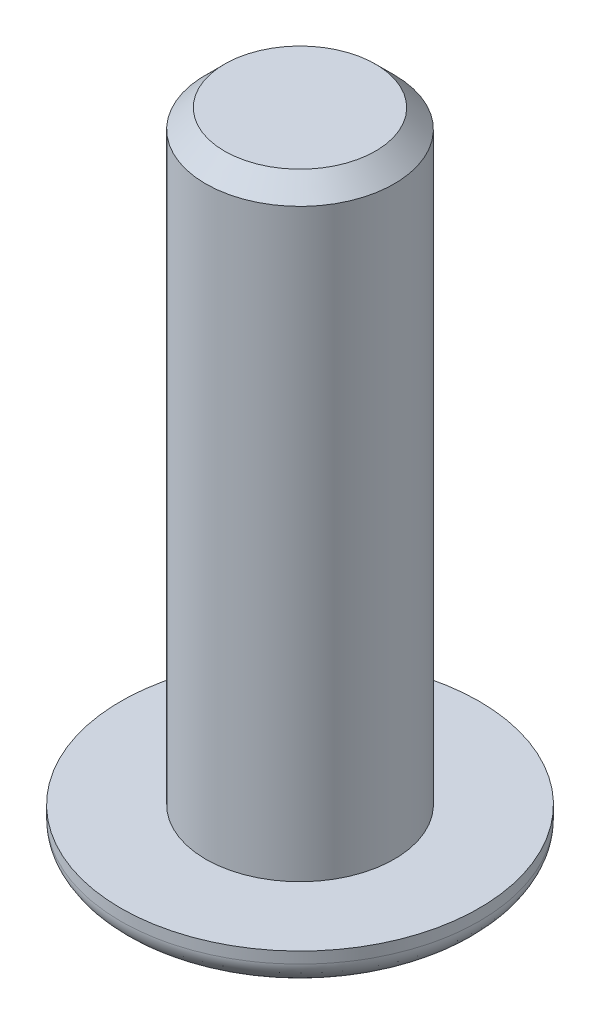
ISO-10303-21;
HEADER;
FILE_DESCRIPTION(('STEP AP214'),'2;1');
FILE_NAME('part.step','',(''),(''),'','','');
FILE_SCHEMA(('AUTOMOTIVE_DESIGN { 1 0 10303 214 1 1 1 1 }'));
ENDSEC;
DATA;
#1=APPLICATION_CONTEXT('core data for automotive mechanical design processes');
#2=APPLICATION_PROTOCOL_DEFINITION('international standard','automotive_design',2000,#1);
#3=PRODUCT_CONTEXT('',#1,'mechanical');
#4=PRODUCT('Part','Part','',(#3));
#5=PRODUCT_RELATED_PRODUCT_CATEGORY('part','',(#4));
#6=PRODUCT_DEFINITION_FORMATION('','',#4);
#7=PRODUCT_DEFINITION_CONTEXT('part definition',#1,'design');
#8=PRODUCT_DEFINITION('design','',#6,#7);
#9=PRODUCT_DEFINITION_SHAPE('','',#8);
#10=(LENGTH_UNIT() NAMED_UNIT(*) SI_UNIT(.MILLI.,.METRE.));
#11=(NAMED_UNIT(*) PLANE_ANGLE_UNIT() SI_UNIT($,.RADIAN.));
#12=(NAMED_UNIT(*) SI_UNIT($,.STERADIAN.) SOLID_ANGLE_UNIT());
#13=UNCERTAINTY_MEASURE_WITH_UNIT(LENGTH_MEASURE(1.E-05),#10,'distance_accuracy_value','');
#14=(GEOMETRIC_REPRESENTATION_CONTEXT(3) GLOBAL_UNCERTAINTY_ASSIGNED_CONTEXT((#13)) GLOBAL_UNIT_ASSIGNED_CONTEXT((#10,
#11,#12)) REPRESENTATION_CONTEXT('',''));
#15=CARTESIAN_POINT('',(0.,0.,0.));
#16=DIRECTION('',(0.,0.,1.));
#17=DIRECTION('',(1.,0.,0.));
#18=AXIS2_PLACEMENT_3D('',#15,#16,#17);
#19=CARTESIAN_POINT('',(0.,1.3,0.));
#20=DIRECTION('',(0.,1.,0.));
#21=DIRECTION('',(0.,0.,1.));
#22=AXIS2_PLACEMENT_3D('',#19,#20,#21);
#23=PLANE('',#22);
#24=CARTESIAN_POINT('',(0.,1.3,0.));
#25=DIRECTION('',(0.,1.,0.));
#26=DIRECTION('',(0.,0.,1.));
#27=AXIS2_PLACEMENT_3D('',#24,#25,#26);
#28=CIRCLE('',#27,2.5);
#29=CARTESIAN_POINT('',(0.,1.3,2.5));
#30=VERTEX_POINT('',#29);
#31=EDGE_CURVE('E297',#30,#30,#28,.T.);
#32=ORIENTED_EDGE('',*,*,#31,.F.);
#33=EDGE_LOOP('',(#32));
#34=FACE_BOUND('',#33,.T.);
#35=CARTESIAN_POINT('',(0.,1.3,0.));
#36=DIRECTION('',(0.,1.,0.));
#37=DIRECTION('',(0.,0.,1.));
#38=AXIS2_PLACEMENT_3D('',#35,#36,#37);
#39=CIRCLE('',#38,4.75);
#40=CARTESIAN_POINT('',(0.,1.3,4.75));
#41=VERTEX_POINT('',#40);
#42=EDGE_CURVE('E136',#41,#41,#39,.T.);
#43=ORIENTED_EDGE('',*,*,#42,.T.);
#44=EDGE_LOOP('',(#43));
#45=FACE_BOUND('',#44,.T.);
#46=ADVANCED_FACE('F41',(#34,#45),#23,.T.);
#47=CARTESIAN_POINT('',(0.,0.,0.));
#48=DIRECTION('',(0.,1.,0.));
#49=DIRECTION('',(0.,0.,1.));
#50=AXIS2_PLACEMENT_3D('',#47,#48,#49);
#51=PLANE('',#50);
#52=CARTESIAN_POINT('',(0.,0.,2.75));
#53=CARTESIAN_POINT('',(0.359974150290737,0.,2.75));
#54=CARTESIAN_POINT('',(0.719806689317475,0.,2.67842485780194));
#55=CARTESIAN_POINT('',(1.38495218869052,0.,2.40291257101014));
#56=CARTESIAN_POINT('',(1.69000348554074,0.,2.19908381098528));
#57=CARTESIAN_POINT('',(2.19908381098528,0.,1.69000348554074));
#58=CARTESIAN_POINT('',(2.40291257101014,0.,1.38495218869056));
#59=CARTESIAN_POINT('',(2.67842485780194,0.,0.719806689317434));
#60=CARTESIAN_POINT('',(2.75,0.,0.359974150290516));
#61=CARTESIAN_POINT('',(2.75,0.,-0.359974150290515));
#62=CARTESIAN_POINT('',(2.67842485780194,0.,-0.719806689317437));
#63=CARTESIAN_POINT('',(2.40291257101014,0.,-1.38495218869056));
#64=CARTESIAN_POINT('',(2.19908381098527,0.,-1.69000348554074));
#65=CARTESIAN_POINT('',(1.69000348554073,0.,-2.19908381098528));
#66=CARTESIAN_POINT('',(1.38495218869055,0.,-2.40291257101014));
#67=CARTESIAN_POINT('',(0.719806689317447,0.,-2.67842485780193));
#68=CARTESIAN_POINT('',(0.359974150290516,0.,-2.75));
#69=CARTESIAN_POINT('',(-0.359974150290515,0.,-2.75));
#70=CARTESIAN_POINT('',(-0.71980668931744,0.,-2.67842485780193));
#71=CARTESIAN_POINT('',(-1.38495218869055,0.,-2.40291257101015));
#72=CARTESIAN_POINT('',(-1.69000348554074,0.,-2.19908381098527));
#73=CARTESIAN_POINT('',(-2.19908381098528,0.,-1.69000348554073));
#74=CARTESIAN_POINT('',(-2.40291257101014,0.,-1.38495218869055));
#75=CARTESIAN_POINT('',(-2.67842485780193,0.,-0.719806689317447));
#76=CARTESIAN_POINT('',(-2.75,0.,-0.359974150290512));
#77=CARTESIAN_POINT('',(-2.75,0.,0.35997415029052));
#78=CARTESIAN_POINT('',(-2.67842485780193,0.,0.719806689317439));
#79=CARTESIAN_POINT('',(-2.40291257101015,0.,1.38495218869055));
#80=CARTESIAN_POINT('',(-2.19908381098532,0.,1.69000348554073));
#81=CARTESIAN_POINT('',(-1.6900034855407,0.,2.19908381098527));
#82=CARTESIAN_POINT('',(-1.38495218869055,0.,2.40291257101014));
#83=CARTESIAN_POINT('',(-0.719806689317447,0.,2.67842485780193));
#84=CARTESIAN_POINT('',(-0.359974150290737,0.,2.75));
#85=CARTESIAN_POINT('',(0.,0.,2.75));
#86=(BOUNDED_CURVE() B_SPLINE_CURVE(3,(#52,#53,#54,#55,#56,#57,#58,#59,#60,#61,#62,#63,#64,#65,
#66,#67,#68,#69,#70,#71,#72,#73,#74,#75,#76,#77,#78,#79,#80,#81,#82,#83,#84,#85),.UNSPECIFIED.,
.T.,.F.) B_SPLINE_CURVE_WITH_KNOTS((4,2,2,2,2,2,2,2,2,2,2,2,2,2,2,2,4),(0.,0.392699081698724,
0.785398163397448,1.17809724509617,1.5707963267949,1.96349540849362,2.35619449019234,
2.74889357189107,3.14159265358979,3.53429173528852,3.92699081698724,4.31968989868597,
4.71238898038469,5.10508806208341,5.49778714378214,5.89048622548086,6.28318530717959),
.UNSPECIFIED.) CURVE() GEOMETRIC_REPRESENTATION_ITEM() RATIONAL_B_SPLINE_CURVE((1.,1.,1.,1.,1.,
1.,1.,1.,1.,1.,1.,1.,1.,1.,1.,1.,1.,1.,1.,1.,1.,1.,1.,1.,1.,1.,1.,1.,1.,1.,1.,1.,1.,1.)) REPRESENTATION_ITEM(''));
#87=CARTESIAN_POINT('',(0.,0.,2.75));
#88=VERTEX_POINT('',#87);
#89=EDGE_CURVE('E12',#88,#88,#86,.F.);
#90=ORIENTED_EDGE('',*,*,#89,.T.);
#91=EDGE_LOOP('',(#90));
#92=FACE_BOUND('',#91,.T.);
#93=DIRECTION('',(0.866025403784439,0.,0.5));
#94=VECTOR('',#93,1.);
#95=CARTESIAN_POINT('',(-1.50000000000001,0.,0.866025403784444));
#96=LINE('',#95,#94);
#97=CARTESIAN_POINT('',(-1.50000000000001,0.,0.866025403784444));
#98=VERTEX_POINT('',#97);
#99=CARTESIAN_POINT('',(0.,0.,1.73205080756888));
#100=VERTEX_POINT('',#99);
#101=EDGE_CURVE('E62',#98,#100,#96,.T.);
#102=ORIENTED_EDGE('',*,*,#101,.T.);
#103=DIRECTION('',(0.866025403784439,0.,-0.5));
#104=VECTOR('',#103,1.);
#105=CARTESIAN_POINT('',(0.,0.,1.73205080756888));
#106=LINE('',#105,#104);
#107=CARTESIAN_POINT('',(1.5,0.,0.866025403784438));
#108=VERTEX_POINT('',#107);
#109=EDGE_CURVE('E122',#100,#108,#106,.T.);
#110=ORIENTED_EDGE('',*,*,#109,.T.);
#111=DIRECTION('',(0.,0.,-1.));
#112=VECTOR('',#111,1.);
#113=CARTESIAN_POINT('',(1.5,0.,0.866025403784438));
#114=LINE('',#113,#112);
#115=CARTESIAN_POINT('',(1.5,0.,-0.866025403784452));
#116=VERTEX_POINT('',#115);
#117=EDGE_CURVE('E120',#108,#116,#114,.T.);
#118=ORIENTED_EDGE('',*,*,#117,.T.);
#119=DIRECTION('',(-0.866025403784438,0.,-0.500000000000001));
#120=VECTOR('',#119,1.);
#121=CARTESIAN_POINT('',(1.5,0.,-0.866025403784452));
#122=LINE('',#121,#120);
#123=CARTESIAN_POINT('',(0.,0.,-1.73205080756889));
#124=VERTEX_POINT('',#123);
#125=EDGE_CURVE('E98',#116,#124,#122,.T.);
#126=ORIENTED_EDGE('',*,*,#125,.T.);
#127=DIRECTION('',(-0.866025403784438,0.,0.5));
#128=VECTOR('',#127,1.);
#129=CARTESIAN_POINT('',(0.,0.,-1.73205080756889));
#130=LINE('',#129,#128);
#131=CARTESIAN_POINT('',(-1.50000000000001,0.,-0.866025403784447));
#132=VERTEX_POINT('',#131);
#133=EDGE_CURVE('E109',#124,#132,#130,.T.);
#134=ORIENTED_EDGE('',*,*,#133,.T.);
#135=DIRECTION('',(0.,0.,1.));
#136=VECTOR('',#135,1.);
#137=CARTESIAN_POINT('',(-1.50000000000001,0.,-0.866025403784447));
#138=LINE('',#137,#136);
#139=EDGE_CURVE('E115',#132,#98,#138,.T.);
#140=ORIENTED_EDGE('',*,*,#139,.T.);
#141=EDGE_LOOP('',(#102,#110,#118,#126,#134,#140));
#142=FACE_BOUND('',#141,.T.);
#143=ADVANCED_FACE('F117',(#92,#142),#51,.F.);
#144=CARTESIAN_POINT('',(0.,1.3,0.));
#145=DIRECTION('',(0.,-1.,0.));
#146=DIRECTION('',(0.,0.,-1.));
#147=AXIS2_PLACEMENT_3D('',#144,#145,#146);
#148=CYLINDRICAL_SURFACE('',#147,4.75);
#149=CARTESIAN_POINT('',(0.,1.,4.75));
#150=CARTESIAN_POINT('',(-0.621773532320364,1.,4.75));
#151=CARTESIAN_POINT('',(-1.24330246336651,1.,4.62637020893059));
#152=CARTESIAN_POINT('',(-2.39219014410186,1.,4.15048534992663));
#153=CARTESIAN_POINT('',(-2.91909692957037,1.,3.79841749170183));
#154=CARTESIAN_POINT('',(-3.79841749170185,1.,2.91909692957035));
#155=CARTESIAN_POINT('',(-4.15048534992664,1.,2.39219014410185));
#156=CARTESIAN_POINT('',(-4.62637020893059,1.,1.24330246336649));
#157=CARTESIAN_POINT('',(-4.75,1.,0.62177353231999));
#158=CARTESIAN_POINT('',(-4.75,1.,-0.621773532319975));
#159=CARTESIAN_POINT('',(-4.62637020893059,1.,-1.24330246336651));
#160=CARTESIAN_POINT('',(-4.15048534992663,1.,-2.39219014410186));
#161=CARTESIAN_POINT('',(-3.79841749170184,1.,-2.91909692957036));
#162=CARTESIAN_POINT('',(-2.91909692957036,1.,-3.79841749170184));
#163=CARTESIAN_POINT('',(-2.39219014410185,1.,-4.15048534992664));
#164=CARTESIAN_POINT('',(-1.24330246336649,1.,-4.62637020893059));
#165=CARTESIAN_POINT('',(-0.621773532319981,1.,-4.75));
#166=CARTESIAN_POINT('',(0.621773532319982,1.,-4.75));
#167=CARTESIAN_POINT('',(1.24330246336651,1.,-4.62637020893059));
#168=CARTESIAN_POINT('',(2.39219014410186,1.,-4.15048534992663));
#169=CARTESIAN_POINT('',(2.91909692957036,1.,-3.79841749170184));
#170=CARTESIAN_POINT('',(3.79841749170184,1.,-2.91909692957036));
#171=CARTESIAN_POINT('',(4.15048534992661,1.,-2.39219014410191));
#172=CARTESIAN_POINT('',(4.62637020893061,1.,-1.24330246336645));
#173=CARTESIAN_POINT('',(4.75,1.,-0.621773532319981));
#174=CARTESIAN_POINT('',(4.75,1.,0.621773532319982));
#175=CARTESIAN_POINT('',(4.62637020893059,1.,1.2433024633665));
#176=CARTESIAN_POINT('',(4.15048534992664,1.,2.39219014410185));
#177=CARTESIAN_POINT('',(3.79841749170187,1.,2.91909692957033));
#178=CARTESIAN_POINT('',(2.91909692957033,1.,3.79841749170187));
#179=CARTESIAN_POINT('',(2.39219014410182,1.,4.15048534992665));
#180=CARTESIAN_POINT('',(1.24330246336654,1.,4.62637020893057));
#181=CARTESIAN_POINT('',(0.621773532320364,1.,4.75));
#182=CARTESIAN_POINT('',(0.,1.,4.75));
#183=(BOUNDED_CURVE() B_SPLINE_CURVE(3,(#149,#150,#151,#152,#153,#154,#155,#156,#157,#158,#159,
#160,#161,#162,#163,#164,#165,#166,#167,#168,#169,#170,#171,#172,#173,#174,#175,#176,#177,#178,
#179,#180,#181,#182),.UNSPECIFIED.,.T.,.F.) B_SPLINE_CURVE_WITH_KNOTS((4,2,2,2,2,2,2,2,2,2,2,2,
2,2,2,2,4),(0.,0.392699081698725,0.785398163397448,1.17809724509617,1.5707963267949,
1.96349540849362,2.35619449019234,2.74889357189107,3.14159265358979,3.53429173528852,
3.92699081698724,4.31968989868597,4.71238898038469,5.10508806208341,5.49778714378214,
5.89048622548086,6.28318530717959),
.UNSPECIFIED.) CURVE() GEOMETRIC_REPRESENTATION_ITEM() RATIONAL_B_SPLINE_CURVE((1.,1.,1.,1.,1.,
1.,1.,1.,1.,1.,1.,1.,1.,1.,1.,1.,1.,1.,1.,1.,1.,1.,1.,1.,1.,1.,1.,1.,1.,1.,1.,1.,1.,1.)) REPRESENTATION_ITEM(''));
#184=CARTESIAN_POINT('',(0.,1.,4.75));
#185=VERTEX_POINT('',#184);
#186=EDGE_CURVE('E55',#185,#185,#183,.F.);
#187=ORIENTED_EDGE('',*,*,#186,.T.);
#188=EDGE_LOOP('',(#187));
#189=FACE_BOUND('',#188,.T.);
#190=ORIENTED_EDGE('',*,*,#42,.F.);
#191=EDGE_LOOP('',(#190));
#192=FACE_BOUND('',#191,.T.);
#193=ADVANCED_FACE('F154',(#189,#192),#148,.T.);
#194=CARTESIAN_POINT('',(-1.50000000000001,1.3,0.866025403784444));
#195=DIRECTION('',(0.5,0.,-0.866025403784439));
#196=DIRECTION('',(-0.866025403784439,0.,-0.5));
#197=AXIS2_PLACEMENT_3D('',#194,#195,#196);
#198=PLANE('',#197);
#199=ORIENTED_EDGE('',*,*,#101,.F.);
#200=DIRECTION('',(0.,-1.,0.));
#201=VECTOR('',#200,1.);
#202=CARTESIAN_POINT('',(-1.50000000000001,1.3,0.866025403784444));
#203=LINE('',#202,#201);
#204=CARTESIAN_POINT('',(-1.50000000000001,1.3,0.866025403784444));
#205=VERTEX_POINT('',#204);
#206=EDGE_CURVE('E127',#205,#98,#203,.T.);
#207=ORIENTED_EDGE('',*,*,#206,.F.);
#208=DIRECTION('',(0.866025403784439,0.,0.5));
#209=VECTOR('',#208,1.);
#210=CARTESIAN_POINT('',(-1.50000000000001,1.3,0.866025403784444));
#211=LINE('',#210,#209);
#212=CARTESIAN_POINT('',(0.,1.3,1.73205080756888));
#213=VERTEX_POINT('',#212);
#214=EDGE_CURVE('E71',#205,#213,#211,.T.);
#215=ORIENTED_EDGE('',*,*,#214,.T.);
#216=DIRECTION('',(0.,-1.,0.));
#217=VECTOR('',#216,1.);
#218=CARTESIAN_POINT('',(0.,1.3,1.73205080756888));
#219=LINE('',#218,#217);
#220=EDGE_CURVE('E134',#213,#100,#219,.T.);
#221=ORIENTED_EDGE('',*,*,#220,.T.);
#222=EDGE_LOOP('',(#199,#207,#215,#221));
#223=FACE_BOUND('',#222,.T.);
#224=ADVANCED_FACE('F163',(#223),#198,.T.);
#225=CARTESIAN_POINT('',(0.,1.3,1.73205080756888));
#226=DIRECTION('',(-0.5,0.,-0.866025403784439));
#227=DIRECTION('',(-0.866025403784439,0.,0.5));
#228=AXIS2_PLACEMENT_3D('',#225,#226,#227);
#229=PLANE('',#228);
#230=ORIENTED_EDGE('',*,*,#109,.F.);
#231=ORIENTED_EDGE('',*,*,#220,.F.);
#232=DIRECTION('',(0.866025403784439,0.,-0.5));
#233=VECTOR('',#232,1.);
#234=CARTESIAN_POINT('',(0.,1.3,1.73205080756888));
#235=LINE('',#234,#233);
#236=CARTESIAN_POINT('',(1.5,1.3,0.866025403784438));
#237=VERTEX_POINT('',#236);
#238=EDGE_CURVE('E302',#213,#237,#235,.T.);
#239=ORIENTED_EDGE('',*,*,#238,.T.);
#240=DIRECTION('',(0.,-1.,0.));
#241=VECTOR('',#240,1.);
#242=CARTESIAN_POINT('',(1.5,1.3,0.866025403784438));
#243=LINE('',#242,#241);
#244=EDGE_CURVE('E132',#237,#108,#243,.T.);
#245=ORIENTED_EDGE('',*,*,#244,.T.);
#246=EDGE_LOOP('',(#230,#231,#239,#245));
#247=FACE_BOUND('',#246,.T.);
#248=ADVANCED_FACE('F194',(#247),#229,.T.);
#249=CARTESIAN_POINT('',(1.5,1.3,0.866025403784438));
#250=DIRECTION('',(-1.,0.,0.));
#251=DIRECTION('',(0.,0.,1.));
#252=AXIS2_PLACEMENT_3D('',#249,#250,#251);
#253=PLANE('',#252);
#254=ORIENTED_EDGE('',*,*,#117,.F.);
#255=ORIENTED_EDGE('',*,*,#244,.F.);
#256=DIRECTION('',(0.,0.,-1.));
#257=VECTOR('',#256,1.);
#258=CARTESIAN_POINT('',(1.5,1.3,0.866025403784438));
#259=LINE('',#258,#257);
#260=CARTESIAN_POINT('',(1.5,1.3,-0.866025403784452));
#261=VERTEX_POINT('',#260);
#262=EDGE_CURVE('E305',#237,#261,#259,.T.);
#263=ORIENTED_EDGE('',*,*,#262,.T.);
#264=DIRECTION('',(0.,-1.,0.));
#265=VECTOR('',#264,1.);
#266=CARTESIAN_POINT('',(1.5,1.3,-0.866025403784452));
#267=LINE('',#266,#265);
#268=EDGE_CURVE('E105',#261,#116,#267,.T.);
#269=ORIENTED_EDGE('',*,*,#268,.T.);
#270=EDGE_LOOP('',(#254,#255,#263,#269));
#271=FACE_BOUND('',#270,.T.);
#272=ADVANCED_FACE('F197',(#271),#253,.T.);
#273=CARTESIAN_POINT('',(1.5,1.3,-0.866025403784452));
#274=DIRECTION('',(-0.500000000000001,0.,0.866025403784438));
#275=DIRECTION('',(0.866025403784438,0.,0.500000000000001));
#276=AXIS2_PLACEMENT_3D('',#273,#274,#275);
#277=PLANE('',#276);
#278=ORIENTED_EDGE('',*,*,#125,.F.);
#279=ORIENTED_EDGE('',*,*,#268,.F.);
#280=DIRECTION('',(-0.866025403784438,0.,-0.500000000000001));
#281=VECTOR('',#280,1.);
#282=CARTESIAN_POINT('',(1.5,1.3,-0.866025403784452));
#283=LINE('',#282,#281);
#284=CARTESIAN_POINT('',(0.,1.3,-1.73205080756889));
#285=VERTEX_POINT('',#284);
#286=EDGE_CURVE('E102',#261,#285,#283,.T.);
#287=ORIENTED_EDGE('',*,*,#286,.T.);
#288=DIRECTION('',(0.,-1.,0.));
#289=VECTOR('',#288,1.);
#290=CARTESIAN_POINT('',(0.,1.3,-1.73205080756889));
#291=LINE('',#290,#289);
#292=EDGE_CURVE('E93',#285,#124,#291,.T.);
#293=ORIENTED_EDGE('',*,*,#292,.T.);
#294=EDGE_LOOP('',(#278,#279,#287,#293));
#295=FACE_BOUND('',#294,.T.);
#296=ADVANCED_FACE('F95',(#295),#277,.T.);
#297=CARTESIAN_POINT('',(0.,1.3,-1.73205080756889));
#298=DIRECTION('',(0.5,0.,0.866025403784438));
#299=DIRECTION('',(0.866025403784438,0.,-0.5));
#300=AXIS2_PLACEMENT_3D('',#297,#298,#299);
#301=PLANE('',#300);
#302=ORIENTED_EDGE('',*,*,#133,.F.);
#303=ORIENTED_EDGE('',*,*,#292,.F.);
#304=DIRECTION('',(-0.866025403784438,0.,0.5));
#305=VECTOR('',#304,1.);
#306=CARTESIAN_POINT('',(0.,1.3,-1.73205080756889));
#307=LINE('',#306,#305);
#308=CARTESIAN_POINT('',(-1.50000000000001,1.3,-0.866025403784447));
#309=VERTEX_POINT('',#308);
#310=EDGE_CURVE('E309',#285,#309,#307,.T.);
#311=ORIENTED_EDGE('',*,*,#310,.T.);
#312=DIRECTION('',(0.,-1.,0.));
#313=VECTOR('',#312,1.);
#314=CARTESIAN_POINT('',(-1.50000000000001,1.3,-0.866025403784447));
#315=LINE('',#314,#313);
#316=EDGE_CURVE('E106',#309,#132,#315,.T.);
#317=ORIENTED_EDGE('',*,*,#316,.T.);
#318=EDGE_LOOP('',(#302,#303,#311,#317));
#319=FACE_BOUND('',#318,.T.);
#320=ADVANCED_FACE('F110',(#319),#301,.T.);
#321=CARTESIAN_POINT('',(-1.50000000000001,1.3,-0.866025403784447));
#322=DIRECTION('',(1.,0.,0.));
#323=DIRECTION('',(0.,0.,-1.));
#324=AXIS2_PLACEMENT_3D('',#321,#322,#323);
#325=PLANE('',#324);
#326=ORIENTED_EDGE('',*,*,#139,.F.);
#327=ORIENTED_EDGE('',*,*,#316,.F.);
#328=DIRECTION('',(0.,0.,1.));
#329=VECTOR('',#328,1.);
#330=CARTESIAN_POINT('',(-1.50000000000001,1.3,-0.866025403784447));
#331=LINE('',#330,#329);
#332=EDGE_CURVE('E129',#309,#205,#331,.T.);
#333=ORIENTED_EDGE('',*,*,#332,.T.);
#334=ORIENTED_EDGE('',*,*,#206,.T.);
#335=EDGE_LOOP('',(#326,#327,#333,#334));
#336=FACE_BOUND('',#335,.T.);
#337=ADVANCED_FACE('F206',(#336),#325,.T.);
#338=CARTESIAN_POINT('',(0.,1.3,0.));
#339=DIRECTION('',(0.,1.,0.));
#340=DIRECTION('',(0.,0.,1.));
#341=AXIS2_PLACEMENT_3D('',#338,#339,#340);
#342=PLANE('',#341);
#343=ORIENTED_EDGE('',*,*,#214,.F.);
#344=ORIENTED_EDGE('',*,*,#332,.F.);
#345=ORIENTED_EDGE('',*,*,#310,.F.);
#346=ORIENTED_EDGE('',*,*,#286,.F.);
#347=ORIENTED_EDGE('',*,*,#262,.F.);
#348=ORIENTED_EDGE('',*,*,#238,.F.);
#349=EDGE_LOOP('',(#343,#344,#345,#346,#347,#348));
#350=FACE_BOUND('',#349,.T.);
#351=ADVANCED_FACE('F209',(#350),#342,.F.);
#352=CARTESIAN_POINT('',(0.,17.3,0.));
#353=DIRECTION('',(0.,-1.,0.));
#354=DIRECTION('',(0.,0.,-1.));
#355=AXIS2_PLACEMENT_3D('',#352,#353,#354);
#356=CYLINDRICAL_SURFACE('',#355,2.5);
#357=CARTESIAN_POINT('',(0.,16.8,0.));
#358=DIRECTION('',(0.,1.,0.));
#359=DIRECTION('',(0.,0.,1.));
#360=AXIS2_PLACEMENT_3D('',#357,#358,#359);
#361=CIRCLE('',#360,2.5);
#362=CARTESIAN_POINT('',(0.,16.8,2.5));
#363=VERTEX_POINT('',#362);
#364=EDGE_CURVE('E142',#363,#363,#361,.F.);
#365=ORIENTED_EDGE('',*,*,#364,.T.);
#366=EDGE_LOOP('',(#365));
#367=FACE_BOUND('',#366,.T.);
#368=ORIENTED_EDGE('',*,*,#31,.T.);
#369=EDGE_LOOP('',(#368));
#370=FACE_BOUND('',#369,.T.);
#371=ADVANCED_FACE('F178',(#367,#370),#356,.T.);
#372=CARTESIAN_POINT('',(0.,17.3,0.));
#373=DIRECTION('',(0.,1.,0.));
#374=DIRECTION('',(0.,0.,1.));
#375=AXIS2_PLACEMENT_3D('',#372,#373,#374);
#376=PLANE('',#375);
#377=CARTESIAN_POINT('',(0.,17.3,0.));
#378=DIRECTION('',(0.,1.,0.));
#379=DIRECTION('',(0.,0.,1.));
#380=AXIS2_PLACEMENT_3D('',#377,#378,#379);
#381=CIRCLE('',#380,2.);
#382=CARTESIAN_POINT('',(0.,17.3,2.));
#383=VERTEX_POINT('',#382);
#384=EDGE_CURVE('E139',#383,#383,#381,.T.);
#385=ORIENTED_EDGE('',*,*,#384,.T.);
#386=EDGE_LOOP('',(#385));
#387=FACE_BOUND('',#386,.T.);
#388=ADVANCED_FACE('F171',(#387),#376,.T.);
#389=CARTESIAN_POINT('',(0.,17.3,0.));
#390=DIRECTION('',(0.,-1.,0.));
#391=DIRECTION('',(0.,0.,-1.));
#392=AXIS2_PLACEMENT_3D('',#389,#390,#391);
#393=CONICAL_SURFACE('',#392,2.,0.785398163397443);
#394=ORIENTED_EDGE('',*,*,#364,.F.);
#395=EDGE_LOOP('',(#394));
#396=FACE_BOUND('',#395,.T.);
#397=ORIENTED_EDGE('',*,*,#384,.F.);
#398=EDGE_LOOP('',(#397));
#399=FACE_BOUND('',#398,.T.);
#400=ADVANCED_FACE('F167',(#396,#399),#393,.T.);
#401=CARTESIAN_POINT('',(0.,1.,4.75));
#402=CARTESIAN_POINT('',(0.621773532320364,1.,4.75));
#403=CARTESIAN_POINT('',(1.24330246336654,1.,4.62637020893057));
#404=CARTESIAN_POINT('',(2.39219014410182,1.,4.15048534992665));
#405=CARTESIAN_POINT('',(2.91909692957033,1.,3.79841749170187));
#406=CARTESIAN_POINT('',(3.79841749170187,1.,2.91909692957033));
#407=CARTESIAN_POINT('',(4.15048534992664,1.,2.39219014410185));
#408=CARTESIAN_POINT('',(4.62637020893059,1.,1.2433024633665));
#409=CARTESIAN_POINT('',(4.75,1.,0.621773532319982));
#410=CARTESIAN_POINT('',(4.75,1.,-0.621773532319981));
#411=CARTESIAN_POINT('',(4.62637020893061,1.,-1.24330246336645));
#412=CARTESIAN_POINT('',(4.15048534992661,1.,-2.39219014410191));
#413=CARTESIAN_POINT('',(3.79841749170184,1.,-2.91909692957036));
#414=CARTESIAN_POINT('',(2.91909692957036,1.,-3.79841749170184));
#415=CARTESIAN_POINT('',(2.39219014410186,1.,-4.15048534992663));
#416=CARTESIAN_POINT('',(1.24330246336651,1.,-4.62637020893059));
#417=CARTESIAN_POINT('',(0.621773532319982,1.,-4.75));
#418=CARTESIAN_POINT('',(-0.621773532319981,1.,-4.75));
#419=CARTESIAN_POINT('',(-1.24330246336649,1.,-4.62637020893059));
#420=CARTESIAN_POINT('',(-2.39219014410185,1.,-4.15048534992664));
#421=CARTESIAN_POINT('',(-2.91909692957036,1.,-3.79841749170184));
#422=CARTESIAN_POINT('',(-3.79841749170184,1.,-2.91909692957036));
#423=CARTESIAN_POINT('',(-4.15048534992663,1.,-2.39219014410186));
#424=CARTESIAN_POINT('',(-4.62637020893059,1.,-1.24330246336651));
#425=CARTESIAN_POINT('',(-4.75,1.,-0.621773532319975));
#426=CARTESIAN_POINT('',(-4.75,1.,0.62177353231999));
#427=CARTESIAN_POINT('',(-4.62637020893059,1.,1.24330246336649));
#428=CARTESIAN_POINT('',(-4.15048534992664,1.,2.39219014410185));
#429=CARTESIAN_POINT('',(-3.79841749170185,1.,2.91909692957035));
#430=CARTESIAN_POINT('',(-2.91909692957037,1.,3.79841749170183));
#431=CARTESIAN_POINT('',(-2.39219014410186,1.,4.15048534992663));
#432=CARTESIAN_POINT('',(-1.24330246336651,1.,4.62637020893059));
#433=CARTESIAN_POINT('',(-0.621773532320364,1.,4.75));
#434=CARTESIAN_POINT('',(0.,1.,4.75));
#435=CARTESIAN_POINT('',(0.,0.,4.75));
#436=CARTESIAN_POINT('',(0.621773532320364,-1.17952791053464E-13,4.75));
#437=CARTESIAN_POINT('',(1.24330246336654,0.,4.62637020893059));
#438=CARTESIAN_POINT('',(2.39219014410181,0.,4.15048534992663));
#439=CARTESIAN_POINT('',(2.91909692957041,0.,3.7984174917018));
#440=CARTESIAN_POINT('',(3.7984174917018,0.,2.91909692957041));
#441=CARTESIAN_POINT('',(4.15048534992663,0.,2.39219014410185));
#442=CARTESIAN_POINT('',(4.62637020893059,0.,1.2433024633665));
#443=CARTESIAN_POINT('',(4.75,0.,0.621773532319982));
#444=CARTESIAN_POINT('',(4.75,0.,-0.621773532319981));
#445=CARTESIAN_POINT('',(4.62637020893075,0.,-1.24330246336651));
#446=CARTESIAN_POINT('',(4.15048534992648,0.,-2.39219014410185));
#447=CARTESIAN_POINT('',(3.79841749170184,0.,-2.91909692957036));
#448=CARTESIAN_POINT('',(2.91909692957036,0.,-3.79841749170184));
#449=CARTESIAN_POINT('',(2.39219014410186,0.,-4.15048534992662));
#450=CARTESIAN_POINT('',(1.24330246336651,0.,-4.6263702089306));
#451=CARTESIAN_POINT('',(0.621773532319982,0.,-4.75));
#452=CARTESIAN_POINT('',(-0.621773532319981,0.,-4.75));
#453=CARTESIAN_POINT('',(-1.2433024633665,0.,-4.6263702089306));
#454=CARTESIAN_POINT('',(-2.39219014410184,0.,-4.15048534992662));
#455=CARTESIAN_POINT('',(-2.91909692957036,0.,-3.79841749170184));
#456=CARTESIAN_POINT('',(-3.79841749170184,0.,-2.91909692957036));
#457=CARTESIAN_POINT('',(-4.15048534992662,0.,-2.39219014410185));
#458=CARTESIAN_POINT('',(-4.6263702089306,0.,-1.24330246336651));
#459=CARTESIAN_POINT('',(-4.75,0.,-0.621773532319975));
#460=CARTESIAN_POINT('',(-4.75,0.,0.62177353231999));
#461=CARTESIAN_POINT('',(-4.6263702089306,0.,1.2433024633665));
#462=CARTESIAN_POINT('',(-4.15048534992663,0.,2.39219014410184));
#463=CARTESIAN_POINT('',(-3.79841749170169,0.,2.91909692957035));
#464=CARTESIAN_POINT('',(-2.91909692957053,0.,3.79841749170183));
#465=CARTESIAN_POINT('',(-2.39219014410186,0.,4.15048534992662));
#466=CARTESIAN_POINT('',(-1.24330246336651,0.,4.6263702089306));
#467=CARTESIAN_POINT('',(-0.621773532320364,1.16218067577487E-13,4.75));
#468=CARTESIAN_POINT('',(0.,0.,4.75));
#469=CARTESIAN_POINT('',(0.,0.,2.75));
#470=CARTESIAN_POINT('',(0.359974150290737,0.,2.75));
#471=CARTESIAN_POINT('',(0.719806689317475,0.,2.67842485780194));
#472=CARTESIAN_POINT('',(1.38495218869052,0.,2.40291257101014));
#473=CARTESIAN_POINT('',(1.69000348554074,0.,2.19908381098528));
#474=CARTESIAN_POINT('',(2.19908381098528,0.,1.69000348554074));
#475=CARTESIAN_POINT('',(2.40291257101014,0.,1.38495218869056));
#476=CARTESIAN_POINT('',(2.67842485780194,0.,0.719806689317434));
#477=CARTESIAN_POINT('',(2.75,0.,0.359974150290516));
#478=CARTESIAN_POINT('',(2.75,0.,-0.359974150290515));
#479=CARTESIAN_POINT('',(2.67842485780194,0.,-0.719806689317437));
#480=CARTESIAN_POINT('',(2.40291257101014,0.,-1.38495218869056));
#481=CARTESIAN_POINT('',(2.19908381098527,0.,-1.69000348554074));
#482=CARTESIAN_POINT('',(1.69000348554073,0.,-2.19908381098528));
#483=CARTESIAN_POINT('',(1.38495218869055,0.,-2.40291257101014));
#484=CARTESIAN_POINT('',(0.719806689317447,0.,-2.67842485780193));
#485=CARTESIAN_POINT('',(0.359974150290516,0.,-2.75));
#486=CARTESIAN_POINT('',(-0.359974150290515,0.,-2.75));
#487=CARTESIAN_POINT('',(-0.71980668931744,0.,-2.67842485780193));
#488=CARTESIAN_POINT('',(-1.38495218869055,0.,-2.40291257101015));
#489=CARTESIAN_POINT('',(-1.69000348554074,0.,-2.19908381098527));
#490=CARTESIAN_POINT('',(-2.19908381098528,0.,-1.69000348554073));
#491=CARTESIAN_POINT('',(-2.40291257101014,0.,-1.38495218869055));
#492=CARTESIAN_POINT('',(-2.67842485780193,0.,-0.719806689317447));
#493=CARTESIAN_POINT('',(-2.75,0.,-0.359974150290512));
#494=CARTESIAN_POINT('',(-2.75,0.,0.35997415029052));
#495=CARTESIAN_POINT('',(-2.67842485780193,0.,0.719806689317439));
#496=CARTESIAN_POINT('',(-2.40291257101015,0.,1.38495218869055));
#497=CARTESIAN_POINT('',(-2.19908381098532,0.,1.69000348554073));
#498=CARTESIAN_POINT('',(-1.6900034855407,0.,2.19908381098527));
#499=CARTESIAN_POINT('',(-1.38495218869055,0.,2.40291257101014));
#500=CARTESIAN_POINT('',(-0.719806689317447,0.,2.67842485780193));
#501=CARTESIAN_POINT('',(-0.359974150290737,0.,2.75));
#502=CARTESIAN_POINT('',(0.,0.,2.75));
#503=(BOUNDED_SURFACE() B_SPLINE_SURFACE(2,3,((#401,#402,#403,#404,#405,#406,#407,#408,#409,
#410,#411,#412,#413,#414,#415,#416,#417,#418,#419,#420,#421,#422,#423,#424,#425,#426,#427,#428,
#429,#430,#431,#432,#433,#434),(#435,#436,#437,#438,#439,#440,#441,#442,#443,#444,#445,#446,
#447,#448,#449,#450,#451,#452,#453,#454,#455,#456,#457,#458,#459,#460,#461,#462,#463,#464,#465,
#466,#467,#468),(#469,#470,#471,#472,#473,#474,#475,#476,#477,#478,#479,#480,#481,#482,#483,
#484,#485,#486,#487,#488,#489,#490,#491,#492,#493,#494,#495,#496,#497,#498,#499,#500,#501,
#502)),.UNSPECIFIED.,.F.,.T.,.F.) B_SPLINE_SURFACE_WITH_KNOTS((3,3),(4,2,2,2,2,2,2,2,2,2,2,2,2,
2,2,2,4),(0.,1.),(0.,0.392699081698724,0.785398163397448,1.17809724509617,1.5707963267949,
1.96349540849362,2.35619449019234,2.74889357189107,3.14159265358979,3.53429173528852,
3.92699081698724,4.31968989868597,4.71238898038469,5.10508806208341,5.49778714378214,
5.89048622548086,6.28318530717959),
.UNSPECIFIED.) GEOMETRIC_REPRESENTATION_ITEM() RATIONAL_B_SPLINE_SURFACE(((1.,1.,1.,1.,1.,1.,1.,
1.,1.,1.,1.,1.,1.,1.,1.,1.,1.,1.,1.,1.,1.,1.,1.,1.,1.,1.,1.,1.,1.,1.,1.,1.,1.,1.),
(0.707106781186547,0.707106781186547,0.707106781186548,0.707106781186548,0.707106781186548,
0.707106781186548,0.707106781186548,0.707106781186548,0.707106781186547,0.707106781186547,
0.707106781186548,0.707106781186548,0.707106781186548,0.707106781186548,0.707106781186548,
0.707106781186548,0.707106781186547,0.707106781186547,0.707106781186548,0.707106781186548,
0.707106781186548,0.707106781186548,0.707106781186548,0.707106781186548,0.707106781186547,
0.707106781186547,0.707106781186548,0.707106781186548,0.707106781186548,0.707106781186548,
0.707106781186548,0.707106781186548,0.707106781186547,0.707106781186547),(1.,1.,1.,1.,1.,1.,1.,
1.,1.,1.,1.,1.,1.,1.,1.,1.,1.,1.,1.,1.,1.,1.,1.,1.,1.,1.,1.,1.,1.,1.,1.,1.,1.,1.))) REPRESENTATION_ITEM('') SURFACE());
#504=ORIENTED_EDGE('',*,*,#89,.F.);
#505=EDGE_LOOP('',(#504));
#506=FACE_BOUND('',#505,.T.);
#507=ORIENTED_EDGE('',*,*,#186,.F.);
#508=EDGE_LOOP('',(#507));
#509=FACE_BOUND('',#508,.T.);
#510=ADVANCED_FACE('F44',(#506,#509),#503,.T.);
#511=CLOSED_SHELL('',(#46,#143,#193,#224,#248,#272,#296,#320,#337,#351,#371,#388,#400,#510));
#512=MANIFOLD_SOLID_BREP('B2',#511);
#513=ADVANCED_BREP_SHAPE_REPRESENTATION('',(#18,#512),#14);
#514=SHAPE_DEFINITION_REPRESENTATION(#9,#513);
ENDSEC;
END-ISO-10303-21;
